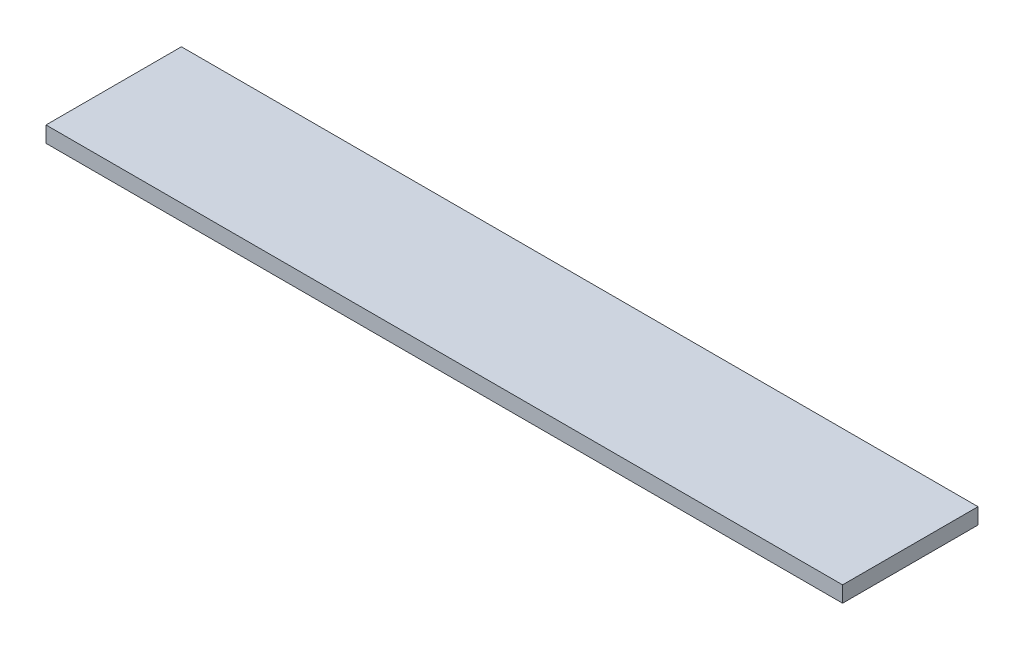
ISO-10303-21;
HEADER;
FILE_DESCRIPTION(('STEP AP214'),'2;1');
FILE_NAME('part.step','',(''),(''),'','','');
FILE_SCHEMA(('AUTOMOTIVE_DESIGN { 1 0 10303 214 1 1 1 1 }'));
ENDSEC;
DATA;
#1=APPLICATION_CONTEXT('core data for automotive mechanical design processes');
#2=APPLICATION_PROTOCOL_DEFINITION('international standard','automotive_design',2000,#1);
#3=PRODUCT_CONTEXT('',#1,'mechanical');
#4=PRODUCT('Part','Part','',(#3));
#5=PRODUCT_RELATED_PRODUCT_CATEGORY('part','',(#4));
#6=PRODUCT_DEFINITION_FORMATION('','',#4);
#7=PRODUCT_DEFINITION_CONTEXT('part definition',#1,'design');
#8=PRODUCT_DEFINITION('design','',#6,#7);
#9=PRODUCT_DEFINITION_SHAPE('','',#8);
#10=(LENGTH_UNIT() NAMED_UNIT(*) SI_UNIT(.MILLI.,.METRE.));
#11=(NAMED_UNIT(*) PLANE_ANGLE_UNIT() SI_UNIT($,.RADIAN.));
#12=(NAMED_UNIT(*) SI_UNIT($,.STERADIAN.) SOLID_ANGLE_UNIT());
#13=UNCERTAINTY_MEASURE_WITH_UNIT(LENGTH_MEASURE(1.E-05),#10,'distance_accuracy_value','');
#14=(GEOMETRIC_REPRESENTATION_CONTEXT(3) GLOBAL_UNCERTAINTY_ASSIGNED_CONTEXT((#13)) GLOBAL_UNIT_ASSIGNED_CONTEXT((#10,
#11,#12)) REPRESENTATION_CONTEXT('',''));
#15=CARTESIAN_POINT('',(0.,0.,0.));
#16=DIRECTION('',(0.,0.,1.));
#17=DIRECTION('',(1.,0.,0.));
#18=AXIS2_PLACEMENT_3D('',#15,#16,#17);
#19=CARTESIAN_POINT('',(250.,-10.,-42.5));
#20=DIRECTION('',(1.,0.,0.));
#21=DIRECTION('',(0.,0.,-1.));
#22=AXIS2_PLACEMENT_3D('',#19,#20,#21);
#23=PLANE('',#22);
#24=DIRECTION('',(0.,0.,-1.));
#25=VECTOR('',#24,1.);
#26=CARTESIAN_POINT('',(250.,0.,-42.5));
#27=LINE('',#26,#25);
#28=CARTESIAN_POINT('',(250.,0.,42.5));
#29=VERTEX_POINT('',#28);
#30=CARTESIAN_POINT('',(250.,0.,-42.5));
#31=VERTEX_POINT('',#30);
#32=EDGE_CURVE('E97',#29,#31,#27,.T.);
#33=ORIENTED_EDGE('',*,*,#32,.F.);
#34=DIRECTION('',(0.,1.,0.));
#35=VECTOR('',#34,1.);
#36=CARTESIAN_POINT('',(250.,-10.,42.5));
#37=LINE('',#36,#35);
#38=CARTESIAN_POINT('',(250.,-10.,42.5));
#39=VERTEX_POINT('',#38);
#40=EDGE_CURVE('E11',#39,#29,#37,.T.);
#41=ORIENTED_EDGE('',*,*,#40,.F.);
#42=DIRECTION('',(0.,0.,-1.));
#43=VECTOR('',#42,1.);
#44=CARTESIAN_POINT('',(250.,-10.,-42.5));
#45=LINE('',#44,#43);
#46=CARTESIAN_POINT('',(250.,-10.,-42.5));
#47=VERTEX_POINT('',#46);
#48=EDGE_CURVE('E91',#39,#47,#45,.T.);
#49=ORIENTED_EDGE('',*,*,#48,.T.);
#50=DIRECTION('',(0.,1.,0.));
#51=VECTOR('',#50,1.);
#52=CARTESIAN_POINT('',(250.,-10.,-42.5));
#53=LINE('',#52,#51);
#54=EDGE_CURVE('E36',#47,#31,#53,.T.);
#55=ORIENTED_EDGE('',*,*,#54,.T.);
#56=EDGE_LOOP('',(#33,#41,#49,#55));
#57=FACE_BOUND('',#56,.T.);
#58=ADVANCED_FACE('F33',(#57),#23,.T.);
#59=CARTESIAN_POINT('',(-250.,-10.,42.5));
#60=DIRECTION('',(0.,0.,1.));
#61=DIRECTION('',(1.,0.,0.));
#62=AXIS2_PLACEMENT_3D('',#59,#60,#61);
#63=PLANE('',#62);
#64=DIRECTION('',(1.,0.,0.));
#65=VECTOR('',#64,1.);
#66=CARTESIAN_POINT('',(-250.,0.,42.5));
#67=LINE('',#66,#65);
#68=CARTESIAN_POINT('',(-250.,0.,42.5));
#69=VERTEX_POINT('',#68);
#70=EDGE_CURVE('E93',#69,#29,#67,.T.);
#71=ORIENTED_EDGE('',*,*,#70,.F.);
#72=DIRECTION('',(0.,1.,0.));
#73=VECTOR('',#72,1.);
#74=CARTESIAN_POINT('',(-250.,-10.,42.5));
#75=LINE('',#74,#73);
#76=CARTESIAN_POINT('',(-250.,-10.,42.5));
#77=VERTEX_POINT('',#76);
#78=EDGE_CURVE('E42',#77,#69,#75,.T.);
#79=ORIENTED_EDGE('',*,*,#78,.F.);
#80=DIRECTION('',(1.,0.,0.));
#81=VECTOR('',#80,1.);
#82=CARTESIAN_POINT('',(-250.,-10.,42.5));
#83=LINE('',#82,#81);
#84=EDGE_CURVE('E88',#77,#39,#83,.T.);
#85=ORIENTED_EDGE('',*,*,#84,.T.);
#86=ORIENTED_EDGE('',*,*,#40,.T.);
#87=EDGE_LOOP('',(#71,#79,#85,#86));
#88=FACE_BOUND('',#87,.T.);
#89=ADVANCED_FACE('F107',(#88),#63,.T.);
#90=CARTESIAN_POINT('',(-250.,-10.,-42.5));
#91=DIRECTION('',(-1.,0.,0.));
#92=DIRECTION('',(0.,0.,1.));
#93=AXIS2_PLACEMENT_3D('',#90,#91,#92);
#94=PLANE('',#93);
#95=DIRECTION('',(0.,0.,1.));
#96=VECTOR('',#95,1.);
#97=CARTESIAN_POINT('',(-250.,0.,-42.5));
#98=LINE('',#97,#96);
#99=CARTESIAN_POINT('',(-250.,0.,-42.5));
#100=VERTEX_POINT('',#99);
#101=EDGE_CURVE('E83',#100,#69,#98,.T.);
#102=ORIENTED_EDGE('',*,*,#101,.F.);
#103=DIRECTION('',(0.,1.,0.));
#104=VECTOR('',#103,1.);
#105=CARTESIAN_POINT('',(-250.,-10.,-42.5));
#106=LINE('',#105,#104);
#107=CARTESIAN_POINT('',(-250.,-10.,-42.5));
#108=VERTEX_POINT('',#107);
#109=EDGE_CURVE('E78',#108,#100,#106,.T.);
#110=ORIENTED_EDGE('',*,*,#109,.F.);
#111=DIRECTION('',(0.,0.,1.));
#112=VECTOR('',#111,1.);
#113=CARTESIAN_POINT('',(-250.,-10.,-42.5));
#114=LINE('',#113,#112);
#115=EDGE_CURVE('E81',#108,#77,#114,.T.);
#116=ORIENTED_EDGE('',*,*,#115,.T.);
#117=ORIENTED_EDGE('',*,*,#78,.T.);
#118=EDGE_LOOP('',(#102,#110,#116,#117));
#119=FACE_BOUND('',#118,.T.);
#120=ADVANCED_FACE('F80',(#119),#94,.T.);
#121=CARTESIAN_POINT('',(-250.,-10.,-42.5));
#122=DIRECTION('',(0.,0.,-1.));
#123=DIRECTION('',(-1.,0.,0.));
#124=AXIS2_PLACEMENT_3D('',#121,#122,#123);
#125=PLANE('',#124);
#126=DIRECTION('',(-1.,0.,0.));
#127=VECTOR('',#126,1.);
#128=CARTESIAN_POINT('',(-250.,0.,-42.5));
#129=LINE('',#128,#127);
#130=EDGE_CURVE('E100',#31,#100,#129,.T.);
#131=ORIENTED_EDGE('',*,*,#130,.F.);
#132=ORIENTED_EDGE('',*,*,#54,.F.);
#133=DIRECTION('',(-1.,0.,0.));
#134=VECTOR('',#133,1.);
#135=CARTESIAN_POINT('',(-250.,-10.,-42.5));
#136=LINE('',#135,#134);
#137=EDGE_CURVE('E87',#47,#108,#136,.T.);
#138=ORIENTED_EDGE('',*,*,#137,.T.);
#139=ORIENTED_EDGE('',*,*,#109,.T.);
#140=EDGE_LOOP('',(#131,#132,#138,#139));
#141=FACE_BOUND('',#140,.T.);
#142=ADVANCED_FACE('F90',(#141),#125,.T.);
#143=CARTESIAN_POINT('',(0.,-10.,0.));
#144=DIRECTION('',(0.,1.,0.));
#145=DIRECTION('',(0.,0.,1.));
#146=AXIS2_PLACEMENT_3D('',#143,#144,#145);
#147=PLANE('',#146);
#148=ORIENTED_EDGE('',*,*,#48,.F.);
#149=ORIENTED_EDGE('',*,*,#84,.F.);
#150=ORIENTED_EDGE('',*,*,#115,.F.);
#151=ORIENTED_EDGE('',*,*,#137,.F.);
#152=EDGE_LOOP('',(#148,#149,#150,#151));
#153=FACE_BOUND('',#152,.T.);
#154=ADVANCED_FACE('F86',(#153),#147,.F.);
#155=CARTESIAN_POINT('',(0.,0.,0.));
#156=DIRECTION('',(0.,1.,0.));
#157=DIRECTION('',(0.,0.,1.));
#158=AXIS2_PLACEMENT_3D('',#155,#156,#157);
#159=PLANE('',#158);
#160=ORIENTED_EDGE('',*,*,#32,.T.);
#161=ORIENTED_EDGE('',*,*,#130,.T.);
#162=ORIENTED_EDGE('',*,*,#101,.T.);
#163=ORIENTED_EDGE('',*,*,#70,.T.);
#164=EDGE_LOOP('',(#160,#161,#162,#163));
#165=FACE_BOUND('',#164,.T.);
#166=ADVANCED_FACE('F106',(#165),#159,.T.);
#167=CLOSED_SHELL('',(#58,#89,#120,#142,#154,#166));
#168=MANIFOLD_SOLID_BREP('B2',#167);
#169=ADVANCED_BREP_SHAPE_REPRESENTATION('',(#18,#168),#14);
#170=SHAPE_DEFINITION_REPRESENTATION(#9,#169);
ENDSEC;
END-ISO-10303-21;
